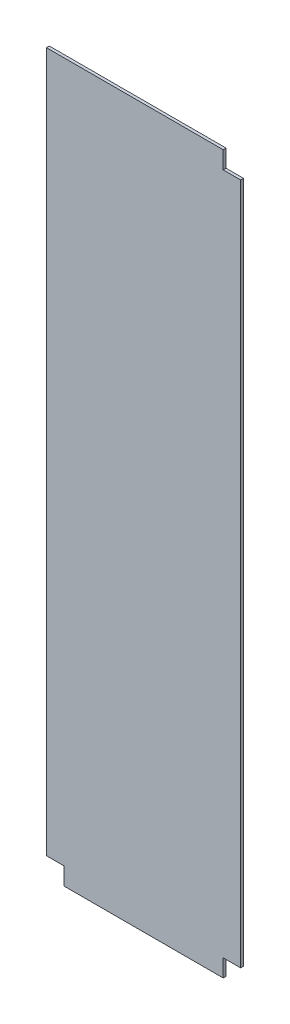
ISO-10303-21;
HEADER;
FILE_DESCRIPTION(('STEP AP214'),'2;1');
FILE_NAME('part.step','',(''),(''),'','','');
FILE_SCHEMA(('AUTOMOTIVE_DESIGN { 1 0 10303 214 1 1 1 1 }'));
ENDSEC;
DATA;
#1=APPLICATION_CONTEXT('core data for automotive mechanical design processes');
#2=APPLICATION_PROTOCOL_DEFINITION('international standard','automotive_design',2000,#1);
#3=PRODUCT_CONTEXT('',#1,'mechanical');
#4=PRODUCT('Part','Part','',(#3));
#5=PRODUCT_RELATED_PRODUCT_CATEGORY('part','',(#4));
#6=PRODUCT_DEFINITION_FORMATION('','',#4);
#7=PRODUCT_DEFINITION_CONTEXT('part definition',#1,'design');
#8=PRODUCT_DEFINITION('design','',#6,#7);
#9=PRODUCT_DEFINITION_SHAPE('','',#8);
#10=(LENGTH_UNIT() NAMED_UNIT(*) SI_UNIT(.MILLI.,.METRE.));
#11=(NAMED_UNIT(*) PLANE_ANGLE_UNIT() SI_UNIT($,.RADIAN.));
#12=(NAMED_UNIT(*) SI_UNIT($,.STERADIAN.) SOLID_ANGLE_UNIT());
#13=UNCERTAINTY_MEASURE_WITH_UNIT(LENGTH_MEASURE(1.E-05),#10,'distance_accuracy_value','');
#14=(GEOMETRIC_REPRESENTATION_CONTEXT(3) GLOBAL_UNCERTAINTY_ASSIGNED_CONTEXT((#13)) GLOBAL_UNIT_ASSIGNED_CONTEXT((#10,
#11,#12)) REPRESENTATION_CONTEXT('',''));
#15=CARTESIAN_POINT('',(0.,0.,0.));
#16=DIRECTION('',(0.,0.,1.));
#17=DIRECTION('',(1.,0.,0.));
#18=AXIS2_PLACEMENT_3D('',#15,#16,#17);
#19=CARTESIAN_POINT('',(0.,0.,3.175));
#20=DIRECTION('',(1.,0.,0.));
#21=DIRECTION('',(0.,0.,-1.));
#22=AXIS2_PLACEMENT_3D('',#19,#20,#21);
#23=PLANE('',#22);
#24=DIRECTION('',(0.,-1.,0.));
#25=VECTOR('',#24,1.);
#26=CARTESIAN_POINT('',(0.,0.,0.));
#27=LINE('',#26,#25);
#28=CARTESIAN_POINT('',(0.,797.2552,0.));
#29=VERTEX_POINT('',#28);
#30=CARTESIAN_POINT('',(0.,19.431,0.));
#31=VERTEX_POINT('',#30);
#32=EDGE_CURVE('E138',#29,#31,#27,.T.);
#33=ORIENTED_EDGE('',*,*,#32,.T.);
#34=DIRECTION('',(0.,0.,1.));
#35=VECTOR('',#34,1.);
#36=CARTESIAN_POINT('',(0.,19.431,0.));
#37=LINE('',#36,#35);
#38=CARTESIAN_POINT('',(0.,19.431,3.175));
#39=VERTEX_POINT('',#38);
#40=EDGE_CURVE('E170',#31,#39,#37,.T.);
#41=ORIENTED_EDGE('',*,*,#40,.T.);
#42=DIRECTION('',(0.,-1.,0.));
#43=VECTOR('',#42,1.);
#44=CARTESIAN_POINT('',(0.,0.,3.175));
#45=LINE('',#44,#43);
#46=CARTESIAN_POINT('',(0.,797.2552,3.175));
#47=VERTEX_POINT('',#46);
#48=EDGE_CURVE('E136',#47,#39,#45,.T.);
#49=ORIENTED_EDGE('',*,*,#48,.F.);
#50=DIRECTION('',(0.,0.,-1.));
#51=VECTOR('',#50,1.);
#52=CARTESIAN_POINT('',(0.,797.2552,3.175));
#53=LINE('',#52,#51);
#54=EDGE_CURVE('E11',#47,#29,#53,.T.);
#55=ORIENTED_EDGE('',*,*,#54,.T.);
#56=EDGE_LOOP('',(#33,#41,#49,#55));
#57=FACE_BOUND('',#56,.T.);
#58=ADVANCED_FACE('F35',(#57),#23,.F.);
#59=CARTESIAN_POINT('',(0.,0.,3.175));
#60=DIRECTION('',(0.,1.,0.));
#61=DIRECTION('',(0.,0.,1.));
#62=AXIS2_PLACEMENT_3D('',#59,#60,#61);
#63=PLANE('',#62);
#64=DIRECTION('',(1.,0.,0.));
#65=VECTOR('',#64,1.);
#66=CARTESIAN_POINT('',(0.,0.,0.));
#67=LINE('',#66,#65);
#68=CARTESIAN_POINT('',(19.431,0.,0.));
#69=VERTEX_POINT('',#68);
#70=CARTESIAN_POINT('',(196.469,0.,0.));
#71=VERTEX_POINT('',#70);
#72=EDGE_CURVE('E134',#69,#71,#67,.T.);
#73=ORIENTED_EDGE('',*,*,#72,.T.);
#74=DIRECTION('',(0.,0.,1.));
#75=VECTOR('',#74,1.);
#76=CARTESIAN_POINT('',(196.469,0.,0.));
#77=LINE('',#76,#75);
#78=CARTESIAN_POINT('',(196.469,0.,3.175));
#79=VERTEX_POINT('',#78);
#80=EDGE_CURVE('E163',#71,#79,#77,.T.);
#81=ORIENTED_EDGE('',*,*,#80,.T.);
#82=DIRECTION('',(1.,0.,0.));
#83=VECTOR('',#82,1.);
#84=CARTESIAN_POINT('',(0.,0.,3.175));
#85=LINE('',#84,#83);
#86=CARTESIAN_POINT('',(19.431,0.,3.175));
#87=VERTEX_POINT('',#86);
#88=EDGE_CURVE('E146',#87,#79,#85,.T.);
#89=ORIENTED_EDGE('',*,*,#88,.F.);
#90=DIRECTION('',(0.,0.,1.));
#91=VECTOR('',#90,1.);
#92=CARTESIAN_POINT('',(19.431,0.,0.));
#93=LINE('',#92,#91);
#94=EDGE_CURVE('E166',#69,#87,#93,.T.);
#95=ORIENTED_EDGE('',*,*,#94,.F.);
#96=EDGE_LOOP('',(#73,#81,#89,#95));
#97=FACE_BOUND('',#96,.T.);
#98=ADVANCED_FACE('F191',(#97),#63,.F.);
#99=CARTESIAN_POINT('',(215.9,0.,3.175));
#100=DIRECTION('',(-1.,0.,0.));
#101=DIRECTION('',(0.,0.,1.));
#102=AXIS2_PLACEMENT_3D('',#99,#100,#101);
#103=PLANE('',#102);
#104=DIRECTION('',(0.,1.,0.));
#105=VECTOR('',#104,1.);
#106=CARTESIAN_POINT('',(215.9,0.,3.175));
#107=LINE('',#106,#105);
#108=CARTESIAN_POINT('',(215.9,19.431,3.175));
#109=VERTEX_POINT('',#108);
#110=CARTESIAN_POINT('',(215.9,777.8242,3.175));
#111=VERTEX_POINT('',#110);
#112=EDGE_CURVE('E127',#109,#111,#107,.T.);
#113=ORIENTED_EDGE('',*,*,#112,.F.);
#114=DIRECTION('',(0.,0.,1.));
#115=VECTOR('',#114,1.);
#116=CARTESIAN_POINT('',(215.9,19.431,0.));
#117=LINE('',#116,#115);
#118=CARTESIAN_POINT('',(215.9,19.431,0.));
#119=VERTEX_POINT('',#118);
#120=EDGE_CURVE('E114',#119,#109,#117,.T.);
#121=ORIENTED_EDGE('',*,*,#120,.F.);
#122=DIRECTION('',(0.,1.,0.));
#123=VECTOR('',#122,1.);
#124=CARTESIAN_POINT('',(215.9,0.,0.));
#125=LINE('',#124,#123);
#126=CARTESIAN_POINT('',(215.9,777.8242,0.));
#127=VERTEX_POINT('',#126);
#128=EDGE_CURVE('E125',#119,#127,#125,.T.);
#129=ORIENTED_EDGE('',*,*,#128,.T.);
#130=DIRECTION('',(0.,0.,1.));
#131=VECTOR('',#130,1.);
#132=CARTESIAN_POINT('',(215.9,777.8242,0.));
#133=LINE('',#132,#131);
#134=EDGE_CURVE('E143',#127,#111,#133,.T.);
#135=ORIENTED_EDGE('',*,*,#134,.T.);
#136=EDGE_LOOP('',(#113,#121,#129,#135));
#137=FACE_BOUND('',#136,.T.);
#138=ADVANCED_FACE('F123',(#137),#103,.F.);
#139=CARTESIAN_POINT('',(0.,797.2552,3.175));
#140=DIRECTION('',(0.,-1.,0.));
#141=DIRECTION('',(0.,0.,-1.));
#142=AXIS2_PLACEMENT_3D('',#139,#140,#141);
#143=PLANE('',#142);
#144=DIRECTION('',(-1.,0.,0.));
#145=VECTOR('',#144,1.);
#146=CARTESIAN_POINT('',(0.,797.2552,3.175));
#147=LINE('',#146,#145);
#148=CARTESIAN_POINT('',(196.469,797.2552,3.175));
#149=VERTEX_POINT('',#148);
#150=EDGE_CURVE('E42',#149,#47,#147,.T.);
#151=ORIENTED_EDGE('',*,*,#150,.F.);
#152=DIRECTION('',(0.,0.,1.));
#153=VECTOR('',#152,1.);
#154=CARTESIAN_POINT('',(196.469,797.2552,0.));
#155=LINE('',#154,#153);
#156=CARTESIAN_POINT('',(196.469,797.2552,0.));
#157=VERTEX_POINT('',#156);
#158=EDGE_CURVE('E151',#157,#149,#155,.T.);
#159=ORIENTED_EDGE('',*,*,#158,.F.);
#160=DIRECTION('',(-1.,0.,0.));
#161=VECTOR('',#160,1.);
#162=CARTESIAN_POINT('',(0.,797.2552,0.));
#163=LINE('',#162,#161);
#164=EDGE_CURVE('E133',#157,#29,#163,.T.);
#165=ORIENTED_EDGE('',*,*,#164,.T.);
#166=ORIENTED_EDGE('',*,*,#54,.F.);
#167=EDGE_LOOP('',(#151,#159,#165,#166));
#168=FACE_BOUND('',#167,.T.);
#169=ADVANCED_FACE('F209',(#168),#143,.F.);
#170=CARTESIAN_POINT('',(0.,0.,3.175));
#171=DIRECTION('',(0.,0.,-1.));
#172=DIRECTION('',(-1.,0.,0.));
#173=AXIS2_PLACEMENT_3D('',#170,#171,#172);
#174=PLANE('',#173);
#175=ORIENTED_EDGE('',*,*,#88,.T.);
#176=DIRECTION('',(0.,-1.,0.));
#177=VECTOR('',#176,1.);
#178=CARTESIAN_POINT('',(196.469,0.,3.175));
#179=LINE('',#178,#177);
#180=CARTESIAN_POINT('',(196.469,19.431,3.175));
#181=VERTEX_POINT('',#180);
#182=EDGE_CURVE('E119',#181,#79,#179,.T.);
#183=ORIENTED_EDGE('',*,*,#182,.F.);
#184=DIRECTION('',(-1.,0.,0.));
#185=VECTOR('',#184,1.);
#186=CARTESIAN_POINT('',(215.9,19.431,3.175));
#187=LINE('',#186,#185);
#188=EDGE_CURVE('E173',#109,#181,#187,.T.);
#189=ORIENTED_EDGE('',*,*,#188,.F.);
#190=ORIENTED_EDGE('',*,*,#112,.T.);
#191=DIRECTION('',(1.,0.,0.));
#192=VECTOR('',#191,1.);
#193=CARTESIAN_POINT('',(215.9,777.8242,3.175));
#194=LINE('',#193,#192);
#195=CARTESIAN_POINT('',(196.469,777.8242,3.175));
#196=VERTEX_POINT('',#195);
#197=EDGE_CURVE('E156',#196,#111,#194,.T.);
#198=ORIENTED_EDGE('',*,*,#197,.F.);
#199=DIRECTION('',(0.,-1.,0.));
#200=VECTOR('',#199,1.);
#201=CARTESIAN_POINT('',(196.469,797.2552,3.175));
#202=LINE('',#201,#200);
#203=EDGE_CURVE('E160',#149,#196,#202,.T.);
#204=ORIENTED_EDGE('',*,*,#203,.F.);
#205=ORIENTED_EDGE('',*,*,#150,.T.);
#206=ORIENTED_EDGE('',*,*,#48,.T.);
#207=DIRECTION('',(-1.,0.,0.));
#208=VECTOR('',#207,1.);
#209=CARTESIAN_POINT('',(0.,19.431,3.175));
#210=LINE('',#209,#208);
#211=CARTESIAN_POINT('',(19.431,19.431,3.175));
#212=VERTEX_POINT('',#211);
#213=EDGE_CURVE('E174',#212,#39,#210,.T.);
#214=ORIENTED_EDGE('',*,*,#213,.F.);
#215=DIRECTION('',(0.,1.,0.));
#216=VECTOR('',#215,1.);
#217=CARTESIAN_POINT('',(19.431,0.,3.175));
#218=LINE('',#217,#216);
#219=EDGE_CURVE('E177',#87,#212,#218,.T.);
#220=ORIENTED_EDGE('',*,*,#219,.F.);
#221=EDGE_LOOP('',(#175,#183,#189,#190,#198,#204,#205,#206,#214,#220));
#222=FACE_BOUND('',#221,.T.);
#223=ADVANCED_FACE('F198',(#222),#174,.F.);
#224=CARTESIAN_POINT('',(0.,0.,0.));
#225=DIRECTION('',(0.,0.,-1.));
#226=DIRECTION('',(-1.,0.,0.));
#227=AXIS2_PLACEMENT_3D('',#224,#225,#226);
#228=PLANE('',#227);
#229=DIRECTION('',(0.,-1.,0.));
#230=VECTOR('',#229,1.);
#231=CARTESIAN_POINT('',(196.469,0.,0.));
#232=LINE('',#231,#230);
#233=CARTESIAN_POINT('',(196.469,19.431,0.));
#234=VERTEX_POINT('',#233);
#235=EDGE_CURVE('E49',#234,#71,#232,.T.);
#236=ORIENTED_EDGE('',*,*,#235,.T.);
#237=ORIENTED_EDGE('',*,*,#72,.F.);
#238=DIRECTION('',(0.,1.,0.));
#239=VECTOR('',#238,1.);
#240=CARTESIAN_POINT('',(19.431,0.,0.));
#241=LINE('',#240,#239);
#242=CARTESIAN_POINT('',(19.431,19.431,0.));
#243=VERTEX_POINT('',#242);
#244=EDGE_CURVE('E176',#69,#243,#241,.T.);
#245=ORIENTED_EDGE('',*,*,#244,.T.);
#246=DIRECTION('',(-1.,0.,0.));
#247=VECTOR('',#246,1.);
#248=CARTESIAN_POINT('',(0.,19.431,0.));
#249=LINE('',#248,#247);
#250=EDGE_CURVE('E57',#243,#31,#249,.T.);
#251=ORIENTED_EDGE('',*,*,#250,.T.);
#252=ORIENTED_EDGE('',*,*,#32,.F.);
#253=ORIENTED_EDGE('',*,*,#164,.F.);
#254=DIRECTION('',(0.,-1.,0.));
#255=VECTOR('',#254,1.);
#256=CARTESIAN_POINT('',(196.469,797.2552,0.));
#257=LINE('',#256,#255);
#258=CARTESIAN_POINT('',(196.469,777.8242,0.));
#259=VERTEX_POINT('',#258);
#260=EDGE_CURVE('E159',#157,#259,#257,.T.);
#261=ORIENTED_EDGE('',*,*,#260,.T.);
#262=DIRECTION('',(1.,0.,0.));
#263=VECTOR('',#262,1.);
#264=CARTESIAN_POINT('',(215.9,777.8242,0.));
#265=LINE('',#264,#263);
#266=EDGE_CURVE('E132',#259,#127,#265,.T.);
#267=ORIENTED_EDGE('',*,*,#266,.T.);
#268=ORIENTED_EDGE('',*,*,#128,.F.);
#269=DIRECTION('',(-1.,0.,0.));
#270=VECTOR('',#269,1.);
#271=CARTESIAN_POINT('',(215.9,19.431,0.));
#272=LINE('',#271,#270);
#273=EDGE_CURVE('E110',#119,#234,#272,.T.);
#274=ORIENTED_EDGE('',*,*,#273,.T.);
#275=EDGE_LOOP('',(#236,#237,#245,#251,#252,#253,#261,#267,#268,#274));
#276=FACE_BOUND('',#275,.T.);
#277=ADVANCED_FACE('F130',(#276),#228,.T.);
#278=CARTESIAN_POINT('',(215.9,777.8242,0.));
#279=DIRECTION('',(0.,-1.,0.));
#280=DIRECTION('',(0.,0.,-1.));
#281=AXIS2_PLACEMENT_3D('',#278,#279,#280);
#282=PLANE('',#281);
#283=ORIENTED_EDGE('',*,*,#197,.T.);
#284=ORIENTED_EDGE('',*,*,#134,.F.);
#285=ORIENTED_EDGE('',*,*,#266,.F.);
#286=DIRECTION('',(0.,0.,1.));
#287=VECTOR('',#286,1.);
#288=CARTESIAN_POINT('',(196.469,777.8242,0.));
#289=LINE('',#288,#287);
#290=EDGE_CURVE('E153',#259,#196,#289,.T.);
#291=ORIENTED_EDGE('',*,*,#290,.T.);
#292=EDGE_LOOP('',(#283,#284,#285,#291));
#293=FACE_BOUND('',#292,.T.);
#294=ADVANCED_FACE('F216',(#293),#282,.F.);
#295=CARTESIAN_POINT('',(196.469,797.2552,0.));
#296=DIRECTION('',(-1.,0.,0.));
#297=DIRECTION('',(0.,0.,1.));
#298=AXIS2_PLACEMENT_3D('',#295,#296,#297);
#299=PLANE('',#298);
#300=ORIENTED_EDGE('',*,*,#203,.T.);
#301=ORIENTED_EDGE('',*,*,#290,.F.);
#302=ORIENTED_EDGE('',*,*,#260,.F.);
#303=ORIENTED_EDGE('',*,*,#158,.T.);
#304=EDGE_LOOP('',(#300,#301,#302,#303));
#305=FACE_BOUND('',#304,.T.);
#306=ADVANCED_FACE('F212',(#305),#299,.F.);
#307=CARTESIAN_POINT('',(0.,19.431,0.));
#308=DIRECTION('',(0.,1.,0.));
#309=DIRECTION('',(0.,0.,1.));
#310=AXIS2_PLACEMENT_3D('',#307,#308,#309);
#311=PLANE('',#310);
#312=ORIENTED_EDGE('',*,*,#213,.T.);
#313=ORIENTED_EDGE('',*,*,#40,.F.);
#314=ORIENTED_EDGE('',*,*,#250,.F.);
#315=DIRECTION('',(0.,0.,1.));
#316=VECTOR('',#315,1.);
#317=CARTESIAN_POINT('',(19.431,19.431,0.));
#318=LINE('',#317,#316);
#319=EDGE_CURVE('E168',#243,#212,#318,.T.);
#320=ORIENTED_EDGE('',*,*,#319,.T.);
#321=EDGE_LOOP('',(#312,#313,#314,#320));
#322=FACE_BOUND('',#321,.T.);
#323=ADVANCED_FACE('F201',(#322),#311,.F.);
#324=CARTESIAN_POINT('',(19.431,0.,0.));
#325=DIRECTION('',(1.,0.,0.));
#326=DIRECTION('',(0.,0.,-1.));
#327=AXIS2_PLACEMENT_3D('',#324,#325,#326);
#328=PLANE('',#327);
#329=ORIENTED_EDGE('',*,*,#219,.T.);
#330=ORIENTED_EDGE('',*,*,#319,.F.);
#331=ORIENTED_EDGE('',*,*,#244,.F.);
#332=ORIENTED_EDGE('',*,*,#94,.T.);
#333=EDGE_LOOP('',(#329,#330,#331,#332));
#334=FACE_BOUND('',#333,.T.);
#335=ADVANCED_FACE('F195',(#334),#328,.F.);
#336=CARTESIAN_POINT('',(196.469,0.,0.));
#337=DIRECTION('',(-1.,0.,0.));
#338=DIRECTION('',(0.,0.,1.));
#339=AXIS2_PLACEMENT_3D('',#336,#337,#338);
#340=PLANE('',#339);
#341=ORIENTED_EDGE('',*,*,#182,.T.);
#342=ORIENTED_EDGE('',*,*,#80,.F.);
#343=ORIENTED_EDGE('',*,*,#235,.F.);
#344=DIRECTION('',(0.,0.,1.));
#345=VECTOR('',#344,1.);
#346=CARTESIAN_POINT('',(196.469,19.431,0.));
#347=LINE('',#346,#345);
#348=EDGE_CURVE('E116',#234,#181,#347,.T.);
#349=ORIENTED_EDGE('',*,*,#348,.T.);
#350=EDGE_LOOP('',(#341,#342,#343,#349));
#351=FACE_BOUND('',#350,.T.);
#352=ADVANCED_FACE('F302',(#351),#340,.F.);
#353=CARTESIAN_POINT('',(215.9,19.431,0.));
#354=DIRECTION('',(0.,1.,0.));
#355=DIRECTION('',(-1.,0.,0.));
#356=AXIS2_PLACEMENT_3D('',#353,#354,#355);
#357=PLANE('',#356);
#358=ORIENTED_EDGE('',*,*,#188,.T.);
#359=ORIENTED_EDGE('',*,*,#348,.F.);
#360=ORIENTED_EDGE('',*,*,#273,.F.);
#361=ORIENTED_EDGE('',*,*,#120,.T.);
#362=EDGE_LOOP('',(#358,#359,#360,#361));
#363=FACE_BOUND('',#362,.T.);
#364=ADVANCED_FACE('F113',(#363),#357,.F.);
#365=CLOSED_SHELL('',(#58,#98,#138,#169,#223,#277,#294,#306,#323,#335,#352,#364));
#366=MANIFOLD_SOLID_BREP('B2',#365);
#367=ADVANCED_BREP_SHAPE_REPRESENTATION('',(#18,#366),#14);
#368=SHAPE_DEFINITION_REPRESENTATION(#9,#367);
ENDSEC;
END-ISO-10303-21;
